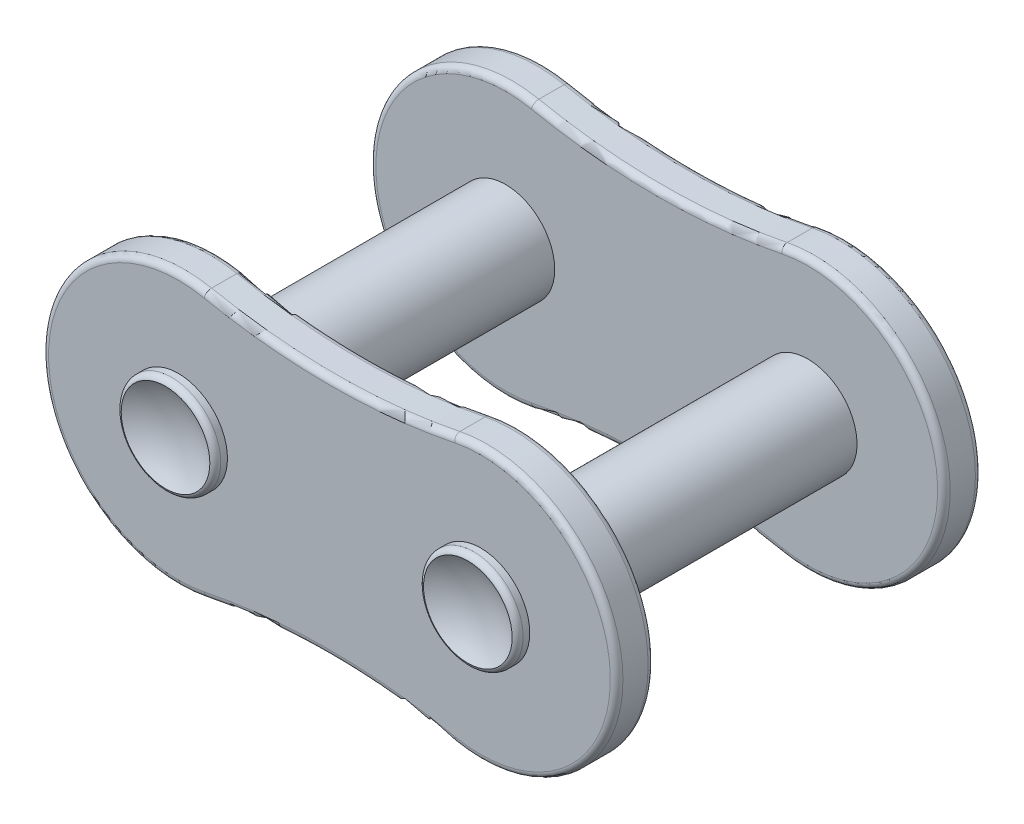
ISO-10303-21;
HEADER;
FILE_DESCRIPTION(('STEP AP214'),'2;1');
FILE_NAME('part.step','',(''),(''),'','','');
FILE_SCHEMA(('AUTOMOTIVE_DESIGN { 1 0 10303 214 1 1 1 1 }'));
ENDSEC;
DATA;
#1=APPLICATION_CONTEXT('core data for automotive mechanical design processes');
#2=APPLICATION_PROTOCOL_DEFINITION('international standard','automotive_design',2000,#1);
#3=PRODUCT_CONTEXT('',#1,'mechanical');
#4=PRODUCT('Part','Part','',(#3));
#5=PRODUCT_RELATED_PRODUCT_CATEGORY('part','',(#4));
#6=PRODUCT_DEFINITION_FORMATION('','',#4);
#7=PRODUCT_DEFINITION_CONTEXT('part definition',#1,'design');
#8=PRODUCT_DEFINITION('design','',#6,#7);
#9=PRODUCT_DEFINITION_SHAPE('','',#8);
#10=(LENGTH_UNIT() NAMED_UNIT(*) SI_UNIT(.MILLI.,.METRE.));
#11=(NAMED_UNIT(*) PLANE_ANGLE_UNIT() SI_UNIT($,.RADIAN.));
#12=(NAMED_UNIT(*) SI_UNIT($,.STERADIAN.) SOLID_ANGLE_UNIT());
#13=UNCERTAINTY_MEASURE_WITH_UNIT(LENGTH_MEASURE(1.E-05),#10,'distance_accuracy_value','');
#14=(GEOMETRIC_REPRESENTATION_CONTEXT(3) GLOBAL_UNCERTAINTY_ASSIGNED_CONTEXT((#13)) GLOBAL_UNIT_ASSIGNED_CONTEXT((#10,
#11,#12)) REPRESENTATION_CONTEXT('',''));
#15=CARTESIAN_POINT('',(0.,0.,0.));
#16=DIRECTION('',(0.,0.,1.));
#17=DIRECTION('',(1.,0.,0.));
#18=AXIS2_PLACEMENT_3D('',#15,#16,#17);
#19=CARTESIAN_POINT('',(1.5,7.40860737442853,4.373));
#20=DIRECTION('',(0.,0.,1.));
#21=DIRECTION('',(1.,0.,0.));
#22=AXIS2_PLACEMENT_3D('',#19,#20,#21);
#23=PLANE('',#22);
#24=CARTESIAN_POINT('',(0.,-14.8172147488571,4.373));
#25=DIRECTION('',(0.,0.,1.));
#26=DIRECTION('',(1.,0.,0.));
#27=AXIS2_PLACEMENT_3D('',#24,#25,#26);
#28=CIRCLE('',#27,12.5428653557223);
#29=CARTESIAN_POINT('',(-2.48901516065719,-2.52379069931756,4.373));
#30=VERTEX_POINT('',#29);
#31=CARTESIAN_POINT('',(2.48901516065719,-2.52379069931756,4.373));
#32=VERTEX_POINT('',#31);
#33=EDGE_CURVE('E312',#30,#32,#28,.F.);
#34=ORIENTED_EDGE('',*,*,#33,.T.);
#35=CARTESIAN_POINT('',(3.,0.,4.373));
#36=DIRECTION('',(0.,0.,1.));
#37=DIRECTION('',(1.,0.,0.));
#38=AXIS2_PLACEMENT_3D('',#35,#36,#37);
#39=CIRCLE('',#38,2.575);
#40=CARTESIAN_POINT('',(2.48901516065719,2.52379069931756,4.373));
#41=VERTEX_POINT('',#40);
#42=EDGE_CURVE('E314',#32,#41,#39,.T.);
#43=ORIENTED_EDGE('',*,*,#42,.T.);
#44=CARTESIAN_POINT('',(0.,14.8172147488571,4.373));
#45=DIRECTION('',(0.,0.,1.));
#46=DIRECTION('',(1.,0.,0.));
#47=AXIS2_PLACEMENT_3D('',#44,#45,#46);
#48=CIRCLE('',#47,12.5428653557223);
#49=CARTESIAN_POINT('',(-2.48901516065719,2.52379069931755,4.373));
#50=VERTEX_POINT('',#49);
#51=EDGE_CURVE('E197',#41,#50,#48,.F.);
#52=ORIENTED_EDGE('',*,*,#51,.T.);
#53=CARTESIAN_POINT('',(-3.,0.,4.373));
#54=DIRECTION('',(0.,0.,1.));
#55=DIRECTION('',(1.,0.,0.));
#56=AXIS2_PLACEMENT_3D('',#53,#54,#55);
#57=CIRCLE('',#56,2.575);
#58=EDGE_CURVE('E310',#50,#30,#57,.T.);
#59=ORIENTED_EDGE('',*,*,#58,.T.);
#60=EDGE_LOOP('',(#34,#43,#52,#59));
#61=FACE_BOUND('',#60,.T.);
#62=CARTESIAN_POINT('',(-3.,0.,4.373));
#63=DIRECTION('',(0.,0.,1.));
#64=DIRECTION('',(1.,0.,0.));
#65=AXIS2_PLACEMENT_3D('',#62,#63,#64);
#66=CIRCLE('',#65,0.974999999999999);
#67=CARTESIAN_POINT('',(-2.025,0.,4.373));
#68=VERTEX_POINT('',#67);
#69=EDGE_CURVE('E184',#68,#68,#66,.T.);
#70=ORIENTED_EDGE('',*,*,#69,.F.);
#71=EDGE_LOOP('',(#70));
#72=FACE_BOUND('',#71,.T.);
#73=CARTESIAN_POINT('',(3.,0.,4.373));
#74=DIRECTION('',(0.,0.,1.));
#75=DIRECTION('',(-1.,0.,0.));
#76=AXIS2_PLACEMENT_3D('',#73,#74,#75);
#77=CIRCLE('',#76,0.974999999999999);
#78=CARTESIAN_POINT('',(2.025,0.,4.373));
#79=VERTEX_POINT('',#78);
#80=EDGE_CURVE('E279',#79,#79,#77,.T.);
#81=ORIENTED_EDGE('',*,*,#80,.F.);
#82=EDGE_LOOP('',(#81));
#83=FACE_BOUND('',#82,.T.);
#84=ADVANCED_FACE('F46',(#61,#72,#83),#23,.T.);
#85=CARTESIAN_POINT('',(1.5,7.40860737442853,3.623));
#86=DIRECTION('',(0.,0.,1.));
#87=DIRECTION('',(1.,0.,0.));
#88=AXIS2_PLACEMENT_3D('',#85,#86,#87);
#89=PLANE('',#88);
#90=CARTESIAN_POINT('',(0.,14.8172147488571,3.623));
#91=DIRECTION('',(0.,0.,1.));
#92=DIRECTION('',(1.,0.,0.));
#93=AXIS2_PLACEMENT_3D('',#90,#91,#92);
#94=CIRCLE('',#93,12.5428653557223);
#95=CARTESIAN_POINT('',(-2.48901516065719,2.52379069931755,3.623));
#96=VERTEX_POINT('',#95);
#97=CARTESIAN_POINT('',(2.48901516065719,2.52379069931756,3.623));
#98=VERTEX_POINT('',#97);
#99=EDGE_CURVE('E292',#96,#98,#94,.T.);
#100=ORIENTED_EDGE('',*,*,#99,.T.);
#101=CARTESIAN_POINT('',(3.,0.,3.623));
#102=DIRECTION('',(0.,0.,1.));
#103=DIRECTION('',(1.,0.,0.));
#104=AXIS2_PLACEMENT_3D('',#101,#102,#103);
#105=CIRCLE('',#104,2.575);
#106=CARTESIAN_POINT('',(2.48901516065719,-2.52379069931756,3.623));
#107=VERTEX_POINT('',#106);
#108=EDGE_CURVE('E298',#98,#107,#105,.F.);
#109=ORIENTED_EDGE('',*,*,#108,.T.);
#110=CARTESIAN_POINT('',(0.,-14.8172147488571,3.623));
#111=DIRECTION('',(0.,0.,1.));
#112=DIRECTION('',(1.,0.,0.));
#113=AXIS2_PLACEMENT_3D('',#110,#111,#112);
#114=CIRCLE('',#113,12.5428653557223);
#115=CARTESIAN_POINT('',(-2.48901516065719,-2.52379069931756,3.623));
#116=VERTEX_POINT('',#115);
#117=EDGE_CURVE('E296',#107,#116,#114,.T.);
#118=ORIENTED_EDGE('',*,*,#117,.T.);
#119=CARTESIAN_POINT('',(-3.,0.,3.623));
#120=DIRECTION('',(0.,0.,1.));
#121=DIRECTION('',(1.,0.,0.));
#122=AXIS2_PLACEMENT_3D('',#119,#120,#121);
#123=CIRCLE('',#122,2.575);
#124=EDGE_CURVE('E294',#116,#96,#123,.F.);
#125=ORIENTED_EDGE('',*,*,#124,.T.);
#126=EDGE_LOOP('',(#100,#109,#118,#125));
#127=FACE_BOUND('',#126,.T.);
#128=CARTESIAN_POINT('',(-3.,0.,3.623));
#129=DIRECTION('',(0.,0.,1.));
#130=DIRECTION('',(1.,0.,0.));
#131=AXIS2_PLACEMENT_3D('',#128,#129,#130);
#132=CIRCLE('',#131,0.974999999999999);
#133=CARTESIAN_POINT('',(-2.025,0.,3.623));
#134=VERTEX_POINT('',#133);
#135=EDGE_CURVE('E276',#134,#134,#132,.T.);
#136=ORIENTED_EDGE('',*,*,#135,.T.);
#137=EDGE_LOOP('',(#136));
#138=FACE_BOUND('',#137,.T.);
#139=CARTESIAN_POINT('',(3.,0.,3.623));
#140=DIRECTION('',(0.,0.,1.));
#141=DIRECTION('',(1.,0.,0.));
#142=AXIS2_PLACEMENT_3D('',#139,#140,#141);
#143=CIRCLE('',#142,0.974999999999999);
#144=CARTESIAN_POINT('',(3.975,0.,3.623));
#145=VERTEX_POINT('',#144);
#146=EDGE_CURVE('E258',#145,#145,#143,.F.);
#147=ORIENTED_EDGE('',*,*,#146,.F.);
#148=EDGE_LOOP('',(#147));
#149=FACE_BOUND('',#148,.T.);
#150=ADVANCED_FACE('F377',(#127,#138,#149),#89,.F.);
#151=CARTESIAN_POINT('',(0.,14.8172147488571,4.373));
#152=DIRECTION('',(0.,0.,-1.));
#153=DIRECTION('',(-1.,0.,0.));
#154=AXIS2_PLACEMENT_3D('',#151,#152,#153);
#155=CYLINDRICAL_SURFACE('',#154,12.4178653557223);
#156=DIRECTION('',(0.,0.,-1.));
#157=VECTOR('',#156,1.);
#158=CARTESIAN_POINT('',(2.4642100713687,2.64630481093491,4.373));
#159=LINE('',#158,#157);
#160=CARTESIAN_POINT('',(2.4642100713687,2.64630481093491,4.248));
#161=VERTEX_POINT('',#160);
#162=CARTESIAN_POINT('',(2.4642100713687,2.64630481093491,3.748));
#163=VERTEX_POINT('',#162);
#164=EDGE_CURVE('E163',#161,#163,#159,.T.);
#165=ORIENTED_EDGE('',*,*,#164,.T.);
#166=CARTESIAN_POINT('',(0.,14.8172147488571,3.748));
#167=DIRECTION('',(0.,0.,1.));
#168=DIRECTION('',(1.,0.,0.));
#169=AXIS2_PLACEMENT_3D('',#166,#167,#168);
#170=CIRCLE('',#169,12.4178653557223);
#171=CARTESIAN_POINT('',(-2.4642100713687,2.64630481093491,3.748));
#172=VERTEX_POINT('',#171);
#173=EDGE_CURVE('E170',#163,#172,#170,.F.);
#174=ORIENTED_EDGE('',*,*,#173,.T.);
#175=DIRECTION('',(0.,0.,-1.));
#176=VECTOR('',#175,1.);
#177=CARTESIAN_POINT('',(-2.4642100713687,2.64630481093491,4.373));
#178=LINE('',#177,#176);
#179=CARTESIAN_POINT('',(-2.4642100713687,2.64630481093491,4.248));
#180=VERTEX_POINT('',#179);
#181=EDGE_CURVE('E165',#180,#172,#178,.T.);
#182=ORIENTED_EDGE('',*,*,#181,.F.);
#183=CARTESIAN_POINT('',(0.,14.8172147488571,4.248));
#184=DIRECTION('',(0.,0.,1.));
#185=DIRECTION('',(1.,0.,0.));
#186=AXIS2_PLACEMENT_3D('',#183,#184,#185);
#187=CIRCLE('',#186,12.4178653557223);
#188=EDGE_CURVE('E160',#180,#161,#187,.T.);
#189=ORIENTED_EDGE('',*,*,#188,.T.);
#190=EDGE_LOOP('',(#165,#174,#182,#189));
#191=FACE_BOUND('',#190,.T.);
#192=ADVANCED_FACE('F162',(#191),#155,.F.);
#193=CARTESIAN_POINT('',(-3.,0.,4.373));
#194=DIRECTION('',(0.,0.,-1.));
#195=DIRECTION('',(-1.,0.,0.));
#196=AXIS2_PLACEMENT_3D('',#193,#194,#195);
#197=CYLINDRICAL_SURFACE('',#196,2.7);
#198=ORIENTED_EDGE('',*,*,#181,.T.);
#199=CARTESIAN_POINT('',(-3.,0.,3.748));
#200=DIRECTION('',(0.,0.,1.));
#201=DIRECTION('',(1.,0.,0.));
#202=AXIS2_PLACEMENT_3D('',#199,#200,#201);
#203=CIRCLE('',#202,2.7);
#204=CARTESIAN_POINT('',(-2.4642100713687,-2.64630481093492,3.748));
#205=VERTEX_POINT('',#204);
#206=EDGE_CURVE('E307',#172,#205,#203,.T.);
#207=ORIENTED_EDGE('',*,*,#206,.T.);
#208=DIRECTION('',(0.,0.,-1.));
#209=VECTOR('',#208,1.);
#210=CARTESIAN_POINT('',(-2.4642100713687,-2.64630481093492,4.373));
#211=LINE('',#210,#209);
#212=CARTESIAN_POINT('',(-2.4642100713687,-2.64630481093492,4.248));
#213=VERTEX_POINT('',#212);
#214=EDGE_CURVE('E285',#213,#205,#211,.T.);
#215=ORIENTED_EDGE('',*,*,#214,.F.);
#216=CARTESIAN_POINT('',(-3.,0.,4.248));
#217=DIRECTION('',(0.,0.,1.));
#218=DIRECTION('',(1.,0.,0.));
#219=AXIS2_PLACEMENT_3D('',#216,#217,#218);
#220=CIRCLE('',#219,2.7);
#221=EDGE_CURVE('E305',#213,#180,#220,.F.);
#222=ORIENTED_EDGE('',*,*,#221,.T.);
#223=EDGE_LOOP('',(#198,#207,#215,#222));
#224=FACE_BOUND('',#223,.T.);
#225=ADVANCED_FACE('F385',(#224),#197,.T.);
#226=CARTESIAN_POINT('',(0.,-14.8172147488571,4.373));
#227=DIRECTION('',(0.,0.,-1.));
#228=DIRECTION('',(-1.,0.,0.));
#229=AXIS2_PLACEMENT_3D('',#226,#227,#228);
#230=CYLINDRICAL_SURFACE('',#229,12.4178653557223);
#231=ORIENTED_EDGE('',*,*,#214,.T.);
#232=CARTESIAN_POINT('',(0.,-14.8172147488571,3.748));
#233=DIRECTION('',(0.,0.,1.));
#234=DIRECTION('',(1.,0.,0.));
#235=AXIS2_PLACEMENT_3D('',#232,#233,#234);
#236=CIRCLE('',#235,12.4178653557223);
#237=CARTESIAN_POINT('',(2.4642100713687,-2.64630481093491,3.748));
#238=VERTEX_POINT('',#237);
#239=EDGE_CURVE('E303',#205,#238,#236,.F.);
#240=ORIENTED_EDGE('',*,*,#239,.T.);
#241=DIRECTION('',(0.,0.,-1.));
#242=VECTOR('',#241,1.);
#243=CARTESIAN_POINT('',(2.4642100713687,-2.64630481093491,4.373));
#244=LINE('',#243,#242);
#245=CARTESIAN_POINT('',(2.4642100713687,-2.64630481093491,4.248));
#246=VERTEX_POINT('',#245);
#247=EDGE_CURVE('E183',#246,#238,#244,.T.);
#248=ORIENTED_EDGE('',*,*,#247,.F.);
#249=CARTESIAN_POINT('',(0.,-14.8172147488571,4.248));
#250=DIRECTION('',(0.,0.,1.));
#251=DIRECTION('',(1.,0.,0.));
#252=AXIS2_PLACEMENT_3D('',#249,#250,#251);
#253=CIRCLE('',#252,12.4178653557223);
#254=EDGE_CURVE('E301',#246,#213,#253,.T.);
#255=ORIENTED_EDGE('',*,*,#254,.T.);
#256=EDGE_LOOP('',(#231,#240,#248,#255));
#257=FACE_BOUND('',#256,.T.);
#258=ADVANCED_FACE('F395',(#257),#230,.F.);
#259=CARTESIAN_POINT('',(3.,0.,4.373));
#260=DIRECTION('',(0.,0.,-1.));
#261=DIRECTION('',(-1.,0.,0.));
#262=AXIS2_PLACEMENT_3D('',#259,#260,#261);
#263=CYLINDRICAL_SURFACE('',#262,2.7);
#264=ORIENTED_EDGE('',*,*,#247,.T.);
#265=CARTESIAN_POINT('',(3.,0.,3.748));
#266=DIRECTION('',(0.,0.,1.));
#267=DIRECTION('',(1.,0.,0.));
#268=AXIS2_PLACEMENT_3D('',#265,#266,#267);
#269=CIRCLE('',#268,2.7);
#270=EDGE_CURVE('E182',#238,#163,#269,.T.);
#271=ORIENTED_EDGE('',*,*,#270,.T.);
#272=ORIENTED_EDGE('',*,*,#164,.F.);
#273=CARTESIAN_POINT('',(3.,0.,4.248));
#274=DIRECTION('',(0.,0.,1.));
#275=DIRECTION('',(1.,0.,0.));
#276=AXIS2_PLACEMENT_3D('',#273,#274,#275);
#277=CIRCLE('',#276,2.7);
#278=EDGE_CURVE('E179',#161,#246,#277,.F.);
#279=ORIENTED_EDGE('',*,*,#278,.T.);
#280=EDGE_LOOP('',(#264,#271,#272,#279));
#281=FACE_BOUND('',#280,.T.);
#282=ADVANCED_FACE('F178',(#281),#263,.T.);
#283=CARTESIAN_POINT('',(-3.,0.,3.369));
#284=DIRECTION('',(0.,0.,1.));
#285=DIRECTION('',(1.,0.,0.));
#286=AXIS2_PLACEMENT_3D('',#283,#284,#285);
#287=CYLINDRICAL_SURFACE('',#286,0.974999999999999);
#288=CARTESIAN_POINT('',(-3.,0.,3.49044648680803));
#289=DIRECTION('',(0.,0.,-1.));
#290=DIRECTION('',(-1.,0.,0.));
#291=AXIS2_PLACEMENT_3D('',#288,#289,#290);
#292=CIRCLE('',#291,0.974999999999999);
#293=CARTESIAN_POINT('',(-3.975,0.,3.49044648680803));
#294=VERTEX_POINT('',#293);
#295=EDGE_CURVE('E234',#294,#294,#292,.F.);
#296=ORIENTED_EDGE('',*,*,#295,.T.);
#297=EDGE_LOOP('',(#296));
#298=FACE_BOUND('',#297,.T.);
#299=ORIENTED_EDGE('',*,*,#135,.F.);
#300=EDGE_LOOP('',(#299));
#301=FACE_BOUND('',#300,.T.);
#302=ADVANCED_FACE('F394',(#298,#301),#287,.T.);
#303=CARTESIAN_POINT('',(-3.,0.,10.119));
#304=DIRECTION('',(0.,0.,-1.));
#305=DIRECTION('',(-1.,0.,0.));
#306=AXIS2_PLACEMENT_3D('',#303,#304,#305);
#307=CIRCLE('',#306,0.974999999999999);
#308=CARTESIAN_POINT('',(-3.975,0.,10.119));
#309=VERTEX_POINT('',#308);
#310=EDGE_CURVE('E194',#309,#309,#307,.F.);
#311=ORIENTED_EDGE('',*,*,#310,.F.);
#312=EDGE_LOOP('',(#311));
#313=FACE_BOUND('',#312,.T.);
#314=ORIENTED_EDGE('',*,*,#69,.T.);
#315=EDGE_LOOP('',(#314));
#316=FACE_BOUND('',#315,.T.);
#317=ADVANCED_FACE('F475',(#313,#316),#287,.T.);
#318=CARTESIAN_POINT('',(0.,14.8172147488571,10.119));
#319=DIRECTION('',(0.,0.,1.));
#320=DIRECTION('',(1.,0.,0.));
#321=AXIS2_PLACEMENT_3D('',#318,#319,#320);
#322=CYLINDRICAL_SURFACE('',#321,12.4178653557223);
#323=DIRECTION('',(0.,0.,1.));
#324=VECTOR('',#323,1.);
#325=CARTESIAN_POINT('',(2.4642100713687,2.64630481093491,10.119));
#326=LINE('',#325,#324);
#327=CARTESIAN_POINT('',(2.4642100713687,2.64630481093491,10.244));
#328=VERTEX_POINT('',#327);
#329=CARTESIAN_POINT('',(2.4642100713687,2.64630481093491,10.744));
#330=VERTEX_POINT('',#329);
#331=EDGE_CURVE('E273',#328,#330,#326,.T.);
#332=ORIENTED_EDGE('',*,*,#331,.F.);
#333=CARTESIAN_POINT('',(0.,14.8172147488571,10.244));
#334=DIRECTION('',(0.,0.,-1.));
#335=DIRECTION('',(-1.,0.,0.));
#336=AXIS2_PLACEMENT_3D('',#333,#334,#335);
#337=CIRCLE('',#336,12.4178653557223);
#338=CARTESIAN_POINT('',(-2.4642100713687,2.64630481093491,10.244));
#339=VERTEX_POINT('',#338);
#340=EDGE_CURVE('E235',#328,#339,#337,.T.);
#341=ORIENTED_EDGE('',*,*,#340,.T.);
#342=DIRECTION('',(0.,0.,1.));
#343=VECTOR('',#342,1.);
#344=CARTESIAN_POINT('',(-2.4642100713687,2.64630481093491,10.119));
#345=LINE('',#344,#343);
#346=CARTESIAN_POINT('',(-2.4642100713687,2.64630481093491,10.744));
#347=VERTEX_POINT('',#346);
#348=EDGE_CURVE('E264',#339,#347,#345,.T.);
#349=ORIENTED_EDGE('',*,*,#348,.T.);
#350=CARTESIAN_POINT('',(0.,14.8172147488571,10.744));
#351=DIRECTION('',(0.,0.,-1.));
#352=DIRECTION('',(-1.,0.,0.));
#353=AXIS2_PLACEMENT_3D('',#350,#351,#352);
#354=CIRCLE('',#353,12.4178653557223);
#355=EDGE_CURVE('E345',#347,#330,#354,.F.);
#356=ORIENTED_EDGE('',*,*,#355,.T.);
#357=EDGE_LOOP('',(#332,#341,#349,#356));
#358=FACE_BOUND('',#357,.T.);
#359=ADVANCED_FACE('F480',(#358),#322,.F.);
#360=CARTESIAN_POINT('',(3.,0.,10.119));
#361=DIRECTION('',(0.,0.,1.));
#362=DIRECTION('',(1.,0.,0.));
#363=AXIS2_PLACEMENT_3D('',#360,#361,#362);
#364=CYLINDRICAL_SURFACE('',#363,2.7);
#365=DIRECTION('',(0.,0.,1.));
#366=VECTOR('',#365,1.);
#367=CARTESIAN_POINT('',(2.4642100713687,-2.64630481093491,10.119));
#368=LINE('',#367,#366);
#369=CARTESIAN_POINT('',(2.4642100713687,-2.64630481093491,10.244));
#370=VERTEX_POINT('',#369);
#371=CARTESIAN_POINT('',(2.4642100713687,-2.64630481093491,10.744));
#372=VERTEX_POINT('',#371);
#373=EDGE_CURVE('E270',#370,#372,#368,.T.);
#374=ORIENTED_EDGE('',*,*,#373,.F.);
#375=CARTESIAN_POINT('',(3.,0.,10.244));
#376=DIRECTION('',(0.,0.,-1.));
#377=DIRECTION('',(-1.,0.,0.));
#378=AXIS2_PLACEMENT_3D('',#375,#376,#377);
#379=CIRCLE('',#378,2.7);
#380=EDGE_CURVE('E319',#370,#328,#379,.F.);
#381=ORIENTED_EDGE('',*,*,#380,.T.);
#382=ORIENTED_EDGE('',*,*,#331,.T.);
#383=CARTESIAN_POINT('',(3.,0.,10.744));
#384=DIRECTION('',(0.,0.,-1.));
#385=DIRECTION('',(-1.,0.,0.));
#386=AXIS2_PLACEMENT_3D('',#383,#384,#385);
#387=CIRCLE('',#386,2.7);
#388=EDGE_CURVE('E316',#330,#372,#387,.T.);
#389=ORIENTED_EDGE('',*,*,#388,.T.);
#390=EDGE_LOOP('',(#374,#381,#382,#389));
#391=FACE_BOUND('',#390,.T.);
#392=ADVANCED_FACE('F508',(#391),#364,.T.);
#393=CARTESIAN_POINT('',(0.,-14.8172147488571,10.119));
#394=DIRECTION('',(0.,0.,1.));
#395=DIRECTION('',(1.,0.,0.));
#396=AXIS2_PLACEMENT_3D('',#393,#394,#395);
#397=CYLINDRICAL_SURFACE('',#396,12.4178653557223);
#398=DIRECTION('',(0.,0.,1.));
#399=VECTOR('',#398,1.);
#400=CARTESIAN_POINT('',(-2.4642100713687,-2.64630481093492,10.119));
#401=LINE('',#400,#399);
#402=CARTESIAN_POINT('',(-2.4642100713687,-2.64630481093492,10.244));
#403=VERTEX_POINT('',#402);
#404=CARTESIAN_POINT('',(-2.4642100713687,-2.64630481093492,10.744));
#405=VERTEX_POINT('',#404);
#406=EDGE_CURVE('E267',#403,#405,#401,.T.);
#407=ORIENTED_EDGE('',*,*,#406,.F.);
#408=CARTESIAN_POINT('',(0.,-14.8172147488571,10.244));
#409=DIRECTION('',(0.,0.,-1.));
#410=DIRECTION('',(-1.,0.,0.));
#411=AXIS2_PLACEMENT_3D('',#408,#409,#410);
#412=CIRCLE('',#411,12.4178653557223);
#413=EDGE_CURVE('E333',#403,#370,#412,.T.);
#414=ORIENTED_EDGE('',*,*,#413,.T.);
#415=ORIENTED_EDGE('',*,*,#373,.T.);
#416=CARTESIAN_POINT('',(0.,-14.8172147488571,10.744));
#417=DIRECTION('',(0.,0.,-1.));
#418=DIRECTION('',(-1.,0.,0.));
#419=AXIS2_PLACEMENT_3D('',#416,#417,#418);
#420=CIRCLE('',#419,12.4178653557223);
#421=EDGE_CURVE('E331',#372,#405,#420,.F.);
#422=ORIENTED_EDGE('',*,*,#421,.T.);
#423=EDGE_LOOP('',(#407,#414,#415,#422));
#424=FACE_BOUND('',#423,.T.);
#425=ADVANCED_FACE('F504',(#424),#397,.F.);
#426=CARTESIAN_POINT('',(-3.,0.,10.119));
#427=DIRECTION('',(0.,0.,1.));
#428=DIRECTION('',(1.,0.,0.));
#429=AXIS2_PLACEMENT_3D('',#426,#427,#428);
#430=CYLINDRICAL_SURFACE('',#429,2.7);
#431=ORIENTED_EDGE('',*,*,#348,.F.);
#432=CARTESIAN_POINT('',(-3.,0.,10.244));
#433=DIRECTION('',(0.,0.,-1.));
#434=DIRECTION('',(-1.,0.,0.));
#435=AXIS2_PLACEMENT_3D('',#432,#433,#434);
#436=CIRCLE('',#435,2.7);
#437=EDGE_CURVE('E337',#339,#403,#436,.F.);
#438=ORIENTED_EDGE('',*,*,#437,.T.);
#439=ORIENTED_EDGE('',*,*,#406,.T.);
#440=CARTESIAN_POINT('',(-3.,0.,10.744));
#441=DIRECTION('',(0.,0.,-1.));
#442=DIRECTION('',(-1.,0.,0.));
#443=AXIS2_PLACEMENT_3D('',#440,#441,#442);
#444=CIRCLE('',#443,2.7);
#445=EDGE_CURVE('E335',#405,#347,#444,.T.);
#446=ORIENTED_EDGE('',*,*,#445,.T.);
#447=EDGE_LOOP('',(#431,#438,#439,#446));
#448=FACE_BOUND('',#447,.T.);
#449=ADVANCED_FACE('F497',(#448),#430,.T.);
#450=CARTESIAN_POINT('',(1.5,7.40860737442853,10.119));
#451=DIRECTION('',(0.,0.,-1.));
#452=DIRECTION('',(1.,0.,0.));
#453=AXIS2_PLACEMENT_3D('',#450,#451,#452);
#454=PLANE('',#453);
#455=CARTESIAN_POINT('',(0.,14.8172147488571,10.119));
#456=DIRECTION('',(0.,0.,-1.));
#457=DIRECTION('',(-1.,0.,0.));
#458=AXIS2_PLACEMENT_3D('',#455,#456,#457);
#459=CIRCLE('',#458,12.5428653557223);
#460=CARTESIAN_POINT('',(-2.48901516065719,2.52379069931755,10.119));
#461=VERTEX_POINT('',#460);
#462=CARTESIAN_POINT('',(2.48901516065719,2.52379069931756,10.119));
#463=VERTEX_POINT('',#462);
#464=EDGE_CURVE('E322',#461,#463,#459,.F.);
#465=ORIENTED_EDGE('',*,*,#464,.T.);
#466=CARTESIAN_POINT('',(3.,0.,10.119));
#467=DIRECTION('',(0.,0.,-1.));
#468=DIRECTION('',(-1.,0.,0.));
#469=AXIS2_PLACEMENT_3D('',#466,#467,#468);
#470=CIRCLE('',#469,2.575);
#471=CARTESIAN_POINT('',(2.48901516065719,-2.52379069931756,10.119));
#472=VERTEX_POINT('',#471);
#473=EDGE_CURVE('E328',#463,#472,#470,.T.);
#474=ORIENTED_EDGE('',*,*,#473,.T.);
#475=CARTESIAN_POINT('',(0.,-14.8172147488571,10.119));
#476=DIRECTION('',(0.,0.,-1.));
#477=DIRECTION('',(-1.,0.,0.));
#478=AXIS2_PLACEMENT_3D('',#475,#476,#477);
#479=CIRCLE('',#478,12.5428653557223);
#480=CARTESIAN_POINT('',(-2.48901516065719,-2.52379069931756,10.119));
#481=VERTEX_POINT('',#480);
#482=EDGE_CURVE('E326',#472,#481,#479,.F.);
#483=ORIENTED_EDGE('',*,*,#482,.T.);
#484=CARTESIAN_POINT('',(-3.,0.,10.119));
#485=DIRECTION('',(0.,0.,-1.));
#486=DIRECTION('',(-1.,0.,0.));
#487=AXIS2_PLACEMENT_3D('',#484,#485,#486);
#488=CIRCLE('',#487,2.575);
#489=EDGE_CURVE('E324',#481,#461,#488,.T.);
#490=ORIENTED_EDGE('',*,*,#489,.T.);
#491=EDGE_LOOP('',(#465,#474,#483,#490));
#492=FACE_BOUND('',#491,.T.);
#493=CARTESIAN_POINT('',(3.,0.,10.119));
#494=DIRECTION('',(0.,0.,-1.));
#495=DIRECTION('',(-1.,0.,0.));
#496=AXIS2_PLACEMENT_3D('',#493,#494,#495);
#497=CIRCLE('',#496,0.974999999999999);
#498=CARTESIAN_POINT('',(2.025,0.,10.119));
#499=VERTEX_POINT('',#498);
#500=EDGE_CURVE('E368',#499,#499,#497,.F.);
#501=ORIENTED_EDGE('',*,*,#500,.T.);
#502=EDGE_LOOP('',(#501));
#503=FACE_BOUND('',#502,.T.);
#504=ORIENTED_EDGE('',*,*,#310,.T.);
#505=EDGE_LOOP('',(#504));
#506=FACE_BOUND('',#505,.T.);
#507=ADVANCED_FACE('F492',(#492,#503,#506),#454,.T.);
#508=CARTESIAN_POINT('',(1.5,7.40860737442853,10.869));
#509=DIRECTION('',(0.,0.,-1.));
#510=DIRECTION('',(1.,0.,0.));
#511=AXIS2_PLACEMENT_3D('',#508,#509,#510);
#512=PLANE('',#511);
#513=CARTESIAN_POINT('',(0.,-14.8172147488571,10.869));
#514=DIRECTION('',(0.,0.,-1.));
#515=DIRECTION('',(-1.,0.,0.));
#516=AXIS2_PLACEMENT_3D('',#513,#514,#515);
#517=CIRCLE('',#516,12.5428653557223);
#518=CARTESIAN_POINT('',(-2.48901516065719,-2.52379069931756,10.869));
#519=VERTEX_POINT('',#518);
#520=CARTESIAN_POINT('',(2.48901516065719,-2.52379069931756,10.869));
#521=VERTEX_POINT('',#520);
#522=EDGE_CURVE('E61',#519,#521,#517,.T.);
#523=ORIENTED_EDGE('',*,*,#522,.T.);
#524=CARTESIAN_POINT('',(3.,0.,10.869));
#525=DIRECTION('',(0.,0.,-1.));
#526=DIRECTION('',(-1.,0.,0.));
#527=AXIS2_PLACEMENT_3D('',#524,#525,#526);
#528=CIRCLE('',#527,2.575);
#529=CARTESIAN_POINT('',(2.48901516065719,2.52379069931756,10.869));
#530=VERTEX_POINT('',#529);
#531=EDGE_CURVE('E171',#521,#530,#528,.F.);
#532=ORIENTED_EDGE('',*,*,#531,.T.);
#533=CARTESIAN_POINT('',(0.,14.8172147488571,10.869));
#534=DIRECTION('',(0.,0.,-1.));
#535=DIRECTION('',(-1.,0.,0.));
#536=AXIS2_PLACEMENT_3D('',#533,#534,#535);
#537=CIRCLE('',#536,12.5428653557223);
#538=CARTESIAN_POINT('',(-2.48901516065719,2.52379069931755,10.869));
#539=VERTEX_POINT('',#538);
#540=EDGE_CURVE('E339',#530,#539,#537,.T.);
#541=ORIENTED_EDGE('',*,*,#540,.T.);
#542=CARTESIAN_POINT('',(-3.,0.,10.869));
#543=DIRECTION('',(0.,0.,-1.));
#544=DIRECTION('',(-1.,0.,0.));
#545=AXIS2_PLACEMENT_3D('',#542,#543,#544);
#546=CIRCLE('',#545,2.575);
#547=EDGE_CURVE('E66',#539,#519,#546,.F.);
#548=ORIENTED_EDGE('',*,*,#547,.T.);
#549=EDGE_LOOP('',(#523,#532,#541,#548));
#550=FACE_BOUND('',#549,.T.);
#551=CARTESIAN_POINT('',(3.,0.,10.869));
#552=DIRECTION('',(0.,0.,1.));
#553=DIRECTION('',(-1.,0.,0.));
#554=AXIS2_PLACEMENT_3D('',#551,#552,#553);
#555=CIRCLE('',#554,0.974999999999999);
#556=CARTESIAN_POINT('',(2.025,0.,10.869));
#557=VERTEX_POINT('',#556);
#558=EDGE_CURVE('E251',#557,#557,#555,.T.);
#559=ORIENTED_EDGE('',*,*,#558,.F.);
#560=EDGE_LOOP('',(#559));
#561=FACE_BOUND('',#560,.T.);
#562=CARTESIAN_POINT('',(-3.,0.,10.869));
#563=DIRECTION('',(0.,0.,1.));
#564=DIRECTION('',(1.,0.,0.));
#565=AXIS2_PLACEMENT_3D('',#562,#563,#564);
#566=CIRCLE('',#565,0.974999999999999);
#567=CARTESIAN_POINT('',(-2.025,0.,10.869));
#568=VERTEX_POINT('',#567);
#569=EDGE_CURVE('E255',#568,#568,#566,.T.);
#570=ORIENTED_EDGE('',*,*,#569,.F.);
#571=EDGE_LOOP('',(#570));
#572=FACE_BOUND('',#571,.T.);
#573=ADVANCED_FACE('F485',(#550,#561,#572),#512,.F.);
#574=CARTESIAN_POINT('',(-3.,0.,11.001553513192));
#575=DIRECTION('',(0.,0.,1.));
#576=DIRECTION('',(1.,0.,0.));
#577=AXIS2_PLACEMENT_3D('',#574,#575,#576);
#578=CIRCLE('',#577,0.974999999999999);
#579=CARTESIAN_POINT('',(-2.025,0.,11.001553513192));
#580=VERTEX_POINT('',#579);
#581=EDGE_CURVE('E54',#580,#580,#578,.F.);
#582=ORIENTED_EDGE('',*,*,#581,.T.);
#583=EDGE_LOOP('',(#582));
#584=FACE_BOUND('',#583,.T.);
#585=ORIENTED_EDGE('',*,*,#569,.T.);
#586=EDGE_LOOP('',(#585));
#587=FACE_BOUND('',#586,.T.);
#588=ADVANCED_FACE('F240',(#584,#587),#287,.T.);
#589=CARTESIAN_POINT('',(-3.,0.,12.519));
#590=DIRECTION('',(0.,0.,-1.));
#591=DIRECTION('',(1.,0.,0.));
#592=AXIS2_PLACEMENT_3D('',#589,#590,#591);
#593=SPHERICAL_SURFACE('',#592,1.65);
#594=CARTESIAN_POINT('',(-3.,0.,11.123));
#595=DIRECTION('',(0.,0.,-1.));
#596=DIRECTION('',(-1.,0.,0.));
#597=AXIS2_PLACEMENT_3D('',#594,#595,#596);
#598=CIRCLE('',#597,0.879593087740008);
#599=CARTESIAN_POINT('',(-3.87959308774001,0.,11.123));
#600=VERTEX_POINT('',#599);
#601=EDGE_CURVE('E249',#600,#600,#598,.T.);
#602=ORIENTED_EDGE('',*,*,#601,.F.);
#603=EDGE_LOOP('',(#602));
#604=FACE_BOUND('',#603,.T.);
#605=ADVANCED_FACE('F484',(#604),#593,.F.);
#606=CARTESIAN_POINT('',(-3.,0.,1.973));
#607=DIRECTION('',(0.,0.,1.));
#608=DIRECTION('',(1.,0.,0.));
#609=AXIS2_PLACEMENT_3D('',#606,#607,#608);
#610=SPHERICAL_SURFACE('',#609,1.65);
#611=CARTESIAN_POINT('',(-3.,0.,3.369));
#612=DIRECTION('',(0.,0.,-1.));
#613=DIRECTION('',(-1.,0.,0.));
#614=AXIS2_PLACEMENT_3D('',#611,#612,#613);
#615=CIRCLE('',#614,0.879593087740008);
#616=CARTESIAN_POINT('',(-3.87959308774001,0.,3.369));
#617=VERTEX_POINT('',#616);
#618=EDGE_CURVE('E252',#617,#617,#615,.T.);
#619=ORIENTED_EDGE('',*,*,#618,.T.);
#620=EDGE_LOOP('',(#619));
#621=FACE_BOUND('',#620,.T.);
#622=ADVANCED_FACE('F490',(#621),#610,.F.);
#623=CARTESIAN_POINT('',(3.,0.,3.369));
#624=DIRECTION('',(0.,0.,1.));
#625=DIRECTION('',(1.,0.,0.));
#626=AXIS2_PLACEMENT_3D('',#623,#624,#625);
#627=CYLINDRICAL_SURFACE('',#626,0.974999999999999);
#628=CARTESIAN_POINT('',(3.,0.,11.001553513192));
#629=DIRECTION('',(0.,0.,1.));
#630=DIRECTION('',(1.,0.,0.));
#631=AXIS2_PLACEMENT_3D('',#628,#629,#630);
#632=CIRCLE('',#631,0.974999999999999);
#633=CARTESIAN_POINT('',(3.975,0.,11.001553513192));
#634=VERTEX_POINT('',#633);
#635=EDGE_CURVE('E13',#634,#634,#632,.F.);
#636=ORIENTED_EDGE('',*,*,#635,.T.);
#637=EDGE_LOOP('',(#636));
#638=FACE_BOUND('',#637,.T.);
#639=ORIENTED_EDGE('',*,*,#558,.T.);
#640=EDGE_LOOP('',(#639));
#641=FACE_BOUND('',#640,.T.);
#642=ADVANCED_FACE('F553',(#638,#641),#627,.T.);
#643=ORIENTED_EDGE('',*,*,#80,.T.);
#644=EDGE_LOOP('',(#643));
#645=FACE_BOUND('',#644,.T.);
#646=ORIENTED_EDGE('',*,*,#500,.F.);
#647=EDGE_LOOP('',(#646));
#648=FACE_BOUND('',#647,.T.);
#649=ADVANCED_FACE('F550',(#645,#648),#627,.T.);
#650=CARTESIAN_POINT('',(3.,0.,3.49044648680803));
#651=DIRECTION('',(0.,0.,-1.));
#652=DIRECTION('',(-1.,0.,0.));
#653=AXIS2_PLACEMENT_3D('',#650,#651,#652);
#654=CIRCLE('',#653,0.974999999999999);
#655=CARTESIAN_POINT('',(2.025,0.,3.49044648680803));
#656=VERTEX_POINT('',#655);
#657=EDGE_CURVE('E231',#656,#656,#654,.F.);
#658=ORIENTED_EDGE('',*,*,#657,.T.);
#659=EDGE_LOOP('',(#658));
#660=FACE_BOUND('',#659,.T.);
#661=ORIENTED_EDGE('',*,*,#146,.T.);
#662=EDGE_LOOP('',(#661));
#663=FACE_BOUND('',#662,.T.);
#664=ADVANCED_FACE('F375',(#660,#663),#627,.T.);
#665=CARTESIAN_POINT('',(3.,0.,12.519));
#666=DIRECTION('',(0.,0.,-1.));
#667=DIRECTION('',(-1.,0.,0.));
#668=AXIS2_PLACEMENT_3D('',#665,#666,#667);
#669=SPHERICAL_SURFACE('',#668,1.65);
#670=CARTESIAN_POINT('',(3.,0.,11.123));
#671=DIRECTION('',(0.,0.,1.));
#672=DIRECTION('',(1.,0.,0.));
#673=AXIS2_PLACEMENT_3D('',#670,#671,#672);
#674=CIRCLE('',#673,0.879593087740008);
#675=CARTESIAN_POINT('',(3.87959308774001,0.,11.123));
#676=VERTEX_POINT('',#675);
#677=EDGE_CURVE('E363',#676,#676,#674,.T.);
#678=ORIENTED_EDGE('',*,*,#677,.T.);
#679=EDGE_LOOP('',(#678));
#680=FACE_BOUND('',#679,.T.);
#681=ADVANCED_FACE('F559',(#680),#669,.F.);
#682=CARTESIAN_POINT('',(3.,0.,1.973));
#683=DIRECTION('',(0.,0.,1.));
#684=DIRECTION('',(-1.,0.,0.));
#685=AXIS2_PLACEMENT_3D('',#682,#683,#684);
#686=SPHERICAL_SURFACE('',#685,1.65);
#687=CARTESIAN_POINT('',(3.,0.,3.369));
#688=DIRECTION('',(0.,0.,1.));
#689=DIRECTION('',(1.,0.,0.));
#690=AXIS2_PLACEMENT_3D('',#687,#688,#689);
#691=CIRCLE('',#690,0.879593087740008);
#692=CARTESIAN_POINT('',(3.87959308774001,0.,3.369));
#693=VERTEX_POINT('',#692);
#694=EDGE_CURVE('E357',#693,#693,#691,.T.);
#695=ORIENTED_EDGE('',*,*,#694,.F.);
#696=EDGE_LOOP('',(#695));
#697=FACE_BOUND('',#696,.T.);
#698=ADVANCED_FACE('F416',(#697),#686,.F.);
#699=CARTESIAN_POINT('',(-3.,0.,3.748));
#700=DIRECTION('',(0.,0.,1.));
#701=DIRECTION('',(1.,0.,0.));
#702=AXIS2_PLACEMENT_3D('',#699,#700,#701);
#703=TOROIDAL_SURFACE('',#702,2.575,0.125);
#704=CARTESIAN_POINT('',(-2.48901516065719,2.52379069931755,3.748));
#705=DIRECTION('',(0.980112892938857,-0.198440714307888,0.));
#706=DIRECTION('',(0.198440714307888,0.980112892938857,0.));
#707=AXIS2_PLACEMENT_3D('',#704,#705,#706);
#708=CIRCLE('',#707,0.125);
#709=EDGE_CURVE('E350',#96,#172,#708,.T.);
#710=ORIENTED_EDGE('',*,*,#709,.F.);
#711=ORIENTED_EDGE('',*,*,#124,.F.);
#712=CARTESIAN_POINT('',(-2.48901516065719,-2.52379069931756,3.748));
#713=DIRECTION('',(0.980112892938857,0.198440714307888,0.));
#714=DIRECTION('',(-0.198440714307888,0.980112892938857,0.));
#715=AXIS2_PLACEMENT_3D('',#712,#713,#714);
#716=CIRCLE('',#715,0.125);
#717=EDGE_CURVE('E207',#205,#116,#716,.T.);
#718=ORIENTED_EDGE('',*,*,#717,.F.);
#719=ORIENTED_EDGE('',*,*,#206,.F.);
#720=EDGE_LOOP('',(#710,#711,#718,#719));
#721=FACE_BOUND('',#720,.T.);
#722=ADVANCED_FACE('F413',(#721),#703,.T.);
#723=CARTESIAN_POINT('',(0.,-14.8172147488571,3.748));
#724=DIRECTION('',(0.,0.,1.));
#725=DIRECTION('',(1.,0.,0.));
#726=AXIS2_PLACEMENT_3D('',#723,#724,#725);
#727=TOROIDAL_SURFACE('',#726,12.5428653557223,0.125);
#728=ORIENTED_EDGE('',*,*,#717,.T.);
#729=ORIENTED_EDGE('',*,*,#117,.F.);
#730=CARTESIAN_POINT('',(2.48901516065719,-2.52379069931755,3.748));
#731=DIRECTION('',(0.980112892938857,-0.198440714307888,0.));
#732=DIRECTION('',(0.198440714307888,0.980112892938857,0.));
#733=AXIS2_PLACEMENT_3D('',#730,#731,#732);
#734=CIRCLE('',#733,0.125);
#735=EDGE_CURVE('E349',#238,#107,#734,.T.);
#736=ORIENTED_EDGE('',*,*,#735,.F.);
#737=ORIENTED_EDGE('',*,*,#239,.F.);
#738=EDGE_LOOP('',(#728,#729,#736,#737));
#739=FACE_BOUND('',#738,.T.);
#740=ADVANCED_FACE('F410',(#739),#727,.T.);
#741=CARTESIAN_POINT('',(0.,14.8172147488571,3.748));
#742=DIRECTION('',(0.,0.,1.));
#743=DIRECTION('',(1.,0.,0.));
#744=AXIS2_PLACEMENT_3D('',#741,#742,#743);
#745=TOROIDAL_SURFACE('',#744,12.5428653557223,0.125);
#746=ORIENTED_EDGE('',*,*,#709,.T.);
#747=ORIENTED_EDGE('',*,*,#173,.F.);
#748=CARTESIAN_POINT('',(2.48901516065719,2.52379069931756,3.748));
#749=DIRECTION('',(0.980112892938857,0.198440714307888,0.));
#750=DIRECTION('',(-0.198440714307888,0.980112892938857,0.));
#751=AXIS2_PLACEMENT_3D('',#748,#749,#750);
#752=CIRCLE('',#751,0.125);
#753=EDGE_CURVE('E214',#98,#163,#752,.T.);
#754=ORIENTED_EDGE('',*,*,#753,.F.);
#755=ORIENTED_EDGE('',*,*,#99,.F.);
#756=EDGE_LOOP('',(#746,#747,#754,#755));
#757=FACE_BOUND('',#756,.T.);
#758=ADVANCED_FACE('F406',(#757),#745,.T.);
#759=CARTESIAN_POINT('',(3.,0.,3.748));
#760=DIRECTION('',(0.,0.,1.));
#761=DIRECTION('',(1.,0.,0.));
#762=AXIS2_PLACEMENT_3D('',#759,#760,#761);
#763=TOROIDAL_SURFACE('',#762,2.575,0.125);
#764=ORIENTED_EDGE('',*,*,#735,.T.);
#765=ORIENTED_EDGE('',*,*,#108,.F.);
#766=ORIENTED_EDGE('',*,*,#753,.T.);
#767=ORIENTED_EDGE('',*,*,#270,.F.);
#768=EDGE_LOOP('',(#764,#765,#766,#767));
#769=FACE_BOUND('',#768,.T.);
#770=ADVANCED_FACE('F402',(#769),#763,.T.);
#771=CARTESIAN_POINT('',(-3.,0.,4.248));
#772=DIRECTION('',(0.,0.,1.));
#773=DIRECTION('',(1.,0.,0.));
#774=AXIS2_PLACEMENT_3D('',#771,#772,#773);
#775=TOROIDAL_SURFACE('',#774,2.575,0.125);
#776=CARTESIAN_POINT('',(-2.48901516065719,2.52379069931755,4.248));
#777=DIRECTION('',(0.980112892938857,-0.198440714307888,0.));
#778=DIRECTION('',(0.198440714307888,0.980112892938857,0.));
#779=AXIS2_PLACEMENT_3D('',#776,#777,#778);
#780=CIRCLE('',#779,0.125);
#781=EDGE_CURVE('E201',#180,#50,#780,.T.);
#782=ORIENTED_EDGE('',*,*,#781,.F.);
#783=ORIENTED_EDGE('',*,*,#221,.F.);
#784=CARTESIAN_POINT('',(-2.48901516065719,-2.52379069931756,4.248));
#785=DIRECTION('',(0.980112892938857,0.198440714307888,0.));
#786=DIRECTION('',(-0.198440714307888,0.980112892938857,0.));
#787=AXIS2_PLACEMENT_3D('',#784,#785,#786);
#788=CIRCLE('',#787,0.125);
#789=EDGE_CURVE('E211',#30,#213,#788,.T.);
#790=ORIENTED_EDGE('',*,*,#789,.F.);
#791=ORIENTED_EDGE('',*,*,#58,.F.);
#792=EDGE_LOOP('',(#782,#783,#790,#791));
#793=FACE_BOUND('',#792,.T.);
#794=ADVANCED_FACE('F405',(#793),#775,.T.);
#795=CARTESIAN_POINT('',(0.,-14.8172147488571,4.248));
#796=DIRECTION('',(0.,0.,1.));
#797=DIRECTION('',(1.,0.,0.));
#798=AXIS2_PLACEMENT_3D('',#795,#796,#797);
#799=TOROIDAL_SURFACE('',#798,12.5428653557223,0.125);
#800=ORIENTED_EDGE('',*,*,#789,.T.);
#801=ORIENTED_EDGE('',*,*,#254,.F.);
#802=CARTESIAN_POINT('',(2.48901516065719,-2.52379069931756,4.248));
#803=DIRECTION('',(0.980112892938857,-0.198440714307887,0.));
#804=DIRECTION('',(0.198440714307887,0.980112892938857,0.));
#805=AXIS2_PLACEMENT_3D('',#802,#803,#804);
#806=CIRCLE('',#805,0.125);
#807=EDGE_CURVE('E192',#32,#246,#806,.T.);
#808=ORIENTED_EDGE('',*,*,#807,.F.);
#809=ORIENTED_EDGE('',*,*,#33,.F.);
#810=EDGE_LOOP('',(#800,#801,#808,#809));
#811=FACE_BOUND('',#810,.T.);
#812=ADVANCED_FACE('F423',(#811),#799,.T.);
#813=CARTESIAN_POINT('',(0.,14.8172147488571,4.248));
#814=DIRECTION('',(0.,0.,1.));
#815=DIRECTION('',(1.,0.,0.));
#816=AXIS2_PLACEMENT_3D('',#813,#814,#815);
#817=TOROIDAL_SURFACE('',#816,12.5428653557223,0.125);
#818=ORIENTED_EDGE('',*,*,#781,.T.);
#819=ORIENTED_EDGE('',*,*,#51,.F.);
#820=CARTESIAN_POINT('',(2.48901516065719,2.52379069931755,4.248));
#821=DIRECTION('',(0.980112892938857,0.198440714307888,0.));
#822=DIRECTION('',(-0.198440714307888,0.980112892938857,0.));
#823=AXIS2_PLACEMENT_3D('',#820,#821,#822);
#824=CIRCLE('',#823,0.125);
#825=EDGE_CURVE('E189',#161,#41,#824,.T.);
#826=ORIENTED_EDGE('',*,*,#825,.F.);
#827=ORIENTED_EDGE('',*,*,#188,.F.);
#828=EDGE_LOOP('',(#818,#819,#826,#827));
#829=FACE_BOUND('',#828,.T.);
#830=ADVANCED_FACE('F196',(#829),#817,.T.);
#831=CARTESIAN_POINT('',(3.,0.,4.248));
#832=DIRECTION('',(0.,0.,1.));
#833=DIRECTION('',(1.,0.,0.));
#834=AXIS2_PLACEMENT_3D('',#831,#832,#833);
#835=TOROIDAL_SURFACE('',#834,2.575,0.125);
#836=ORIENTED_EDGE('',*,*,#807,.T.);
#837=ORIENTED_EDGE('',*,*,#278,.F.);
#838=ORIENTED_EDGE('',*,*,#825,.T.);
#839=ORIENTED_EDGE('',*,*,#42,.F.);
#840=EDGE_LOOP('',(#836,#837,#838,#839));
#841=FACE_BOUND('',#840,.T.);
#842=ADVANCED_FACE('F187',(#841),#835,.T.);
#843=CARTESIAN_POINT('',(-3.,0.,10.244));
#844=DIRECTION('',(0.,0.,-1.));
#845=DIRECTION('',(-1.,0.,0.));
#846=AXIS2_PLACEMENT_3D('',#843,#844,#845);
#847=TOROIDAL_SURFACE('',#846,2.575,0.125);
#848=CARTESIAN_POINT('',(-2.48901516065719,2.52379069931755,10.244));
#849=DIRECTION('',(0.980112892938857,-0.198440714307888,0.));
#850=DIRECTION('',(0.198440714307888,0.980112892938857,0.));
#851=AXIS2_PLACEMENT_3D('',#848,#849,#850);
#852=CIRCLE('',#851,0.125);
#853=EDGE_CURVE('E204',#461,#339,#852,.T.);
#854=ORIENTED_EDGE('',*,*,#853,.F.);
#855=ORIENTED_EDGE('',*,*,#489,.F.);
#856=CARTESIAN_POINT('',(-2.48901516065719,-2.52379069931756,10.244));
#857=DIRECTION('',(0.980112892938857,0.198440714307888,0.));
#858=DIRECTION('',(-0.198440714307888,0.980112892938857,0.));
#859=AXIS2_PLACEMENT_3D('',#856,#857,#858);
#860=CIRCLE('',#859,0.125);
#861=EDGE_CURVE('E199',#403,#481,#860,.T.);
#862=ORIENTED_EDGE('',*,*,#861,.F.);
#863=ORIENTED_EDGE('',*,*,#437,.F.);
#864=EDGE_LOOP('',(#854,#855,#862,#863));
#865=FACE_BOUND('',#864,.T.);
#866=ADVANCED_FACE('F420',(#865),#847,.T.);
#867=CARTESIAN_POINT('',(0.,-14.8172147488571,10.244));
#868=DIRECTION('',(0.,0.,-1.));
#869=DIRECTION('',(-1.,0.,0.));
#870=AXIS2_PLACEMENT_3D('',#867,#868,#869);
#871=TOROIDAL_SURFACE('',#870,12.5428653557223,0.125);
#872=ORIENTED_EDGE('',*,*,#861,.T.);
#873=ORIENTED_EDGE('',*,*,#482,.F.);
#874=CARTESIAN_POINT('',(2.48901516065719,-2.52379069931755,10.244));
#875=DIRECTION('',(0.980112892938857,-0.198440714307888,0.));
#876=DIRECTION('',(0.198440714307888,0.980112892938857,0.));
#877=AXIS2_PLACEMENT_3D('',#874,#875,#876);
#878=CIRCLE('',#877,0.125);
#879=EDGE_CURVE('E217',#370,#472,#878,.T.);
#880=ORIENTED_EDGE('',*,*,#879,.F.);
#881=ORIENTED_EDGE('',*,*,#413,.F.);
#882=EDGE_LOOP('',(#872,#873,#880,#881));
#883=FACE_BOUND('',#882,.T.);
#884=ADVANCED_FACE('F438',(#883),#871,.T.);
#885=CARTESIAN_POINT('',(0.,14.8172147488571,10.244));
#886=DIRECTION('',(0.,0.,-1.));
#887=DIRECTION('',(-1.,0.,0.));
#888=AXIS2_PLACEMENT_3D('',#885,#886,#887);
#889=TOROIDAL_SURFACE('',#888,12.5428653557223,0.125);
#890=ORIENTED_EDGE('',*,*,#853,.T.);
#891=ORIENTED_EDGE('',*,*,#340,.F.);
#892=CARTESIAN_POINT('',(2.48901516065719,2.52379069931756,10.244));
#893=DIRECTION('',(0.980112892938857,0.198440714307888,0.));
#894=DIRECTION('',(-0.198440714307888,0.980112892938857,0.));
#895=AXIS2_PLACEMENT_3D('',#892,#893,#894);
#896=CIRCLE('',#895,0.125);
#897=EDGE_CURVE('E215',#463,#328,#896,.T.);
#898=ORIENTED_EDGE('',*,*,#897,.F.);
#899=ORIENTED_EDGE('',*,*,#464,.F.);
#900=EDGE_LOOP('',(#890,#891,#898,#899));
#901=FACE_BOUND('',#900,.T.);
#902=ADVANCED_FACE('F434',(#901),#889,.T.);
#903=CARTESIAN_POINT('',(3.,0.,10.244));
#904=DIRECTION('',(0.,0.,-1.));
#905=DIRECTION('',(-1.,0.,0.));
#906=AXIS2_PLACEMENT_3D('',#903,#904,#905);
#907=TOROIDAL_SURFACE('',#906,2.575,0.125);
#908=ORIENTED_EDGE('',*,*,#879,.T.);
#909=ORIENTED_EDGE('',*,*,#473,.F.);
#910=ORIENTED_EDGE('',*,*,#897,.T.);
#911=ORIENTED_EDGE('',*,*,#380,.F.);
#912=EDGE_LOOP('',(#908,#909,#910,#911));
#913=FACE_BOUND('',#912,.T.);
#914=ADVANCED_FACE('F430',(#913),#907,.T.);
#915=CARTESIAN_POINT('',(-3.,0.,10.744));
#916=DIRECTION('',(0.,0.,-1.));
#917=DIRECTION('',(-1.,0.,0.));
#918=AXIS2_PLACEMENT_3D('',#915,#916,#917);
#919=TOROIDAL_SURFACE('',#918,2.575,0.125);
#920=CARTESIAN_POINT('',(-2.48901516065719,2.52379069931755,10.744));
#921=DIRECTION('',(0.980112892938857,-0.198440714307888,0.));
#922=DIRECTION('',(0.198440714307888,0.980112892938857,0.));
#923=AXIS2_PLACEMENT_3D('',#920,#921,#922);
#924=CIRCLE('',#923,0.125);
#925=EDGE_CURVE('E226',#347,#539,#924,.T.);
#926=ORIENTED_EDGE('',*,*,#925,.F.);
#927=ORIENTED_EDGE('',*,*,#445,.F.);
#928=CARTESIAN_POINT('',(-2.48901516065719,-2.52379069931756,10.744));
#929=DIRECTION('',(0.980112892938857,0.198440714307888,0.));
#930=DIRECTION('',(-0.198440714307888,0.980112892938857,0.));
#931=AXIS2_PLACEMENT_3D('',#928,#929,#930);
#932=CIRCLE('',#931,0.125);
#933=EDGE_CURVE('E218',#519,#405,#932,.T.);
#934=ORIENTED_EDGE('',*,*,#933,.F.);
#935=ORIENTED_EDGE('',*,*,#547,.F.);
#936=EDGE_LOOP('',(#926,#927,#934,#935));
#937=FACE_BOUND('',#936,.T.);
#938=ADVANCED_FACE('F433',(#937),#919,.T.);
#939=CARTESIAN_POINT('',(0.,-14.8172147488571,10.744));
#940=DIRECTION('',(0.,0.,-1.));
#941=DIRECTION('',(-1.,0.,0.));
#942=AXIS2_PLACEMENT_3D('',#939,#940,#941);
#943=TOROIDAL_SURFACE('',#942,12.5428653557223,0.125);
#944=ORIENTED_EDGE('',*,*,#933,.T.);
#945=ORIENTED_EDGE('',*,*,#421,.F.);
#946=CARTESIAN_POINT('',(2.48901516065719,-2.52379069931756,10.744));
#947=DIRECTION('',(0.980112892938857,-0.198440714307887,0.));
#948=DIRECTION('',(0.198440714307887,0.980112892938857,0.));
#949=AXIS2_PLACEMENT_3D('',#946,#947,#948);
#950=CIRCLE('',#949,0.125);
#951=EDGE_CURVE('E224',#521,#372,#950,.T.);
#952=ORIENTED_EDGE('',*,*,#951,.F.);
#953=ORIENTED_EDGE('',*,*,#522,.F.);
#954=EDGE_LOOP('',(#944,#945,#952,#953));
#955=FACE_BOUND('',#954,.T.);
#956=ADVANCED_FACE('F454',(#955),#943,.T.);
#957=CARTESIAN_POINT('',(0.,14.8172147488571,10.744));
#958=DIRECTION('',(0.,0.,-1.));
#959=DIRECTION('',(-1.,0.,0.));
#960=AXIS2_PLACEMENT_3D('',#957,#958,#959);
#961=TOROIDAL_SURFACE('',#960,12.5428653557223,0.125);
#962=ORIENTED_EDGE('',*,*,#925,.T.);
#963=ORIENTED_EDGE('',*,*,#540,.F.);
#964=CARTESIAN_POINT('',(2.48901516065719,2.52379069931755,10.744));
#965=DIRECTION('',(0.980112892938857,0.198440714307888,0.));
#966=DIRECTION('',(-0.198440714307888,0.980112892938857,0.));
#967=AXIS2_PLACEMENT_3D('',#964,#965,#966);
#968=CIRCLE('',#967,0.125);
#969=EDGE_CURVE('E222',#330,#530,#968,.T.);
#970=ORIENTED_EDGE('',*,*,#969,.F.);
#971=ORIENTED_EDGE('',*,*,#355,.F.);
#972=EDGE_LOOP('',(#962,#963,#970,#971));
#973=FACE_BOUND('',#972,.T.);
#974=ADVANCED_FACE('F450',(#973),#961,.T.);
#975=CARTESIAN_POINT('',(3.,0.,10.744));
#976=DIRECTION('',(0.,0.,-1.));
#977=DIRECTION('',(-1.,0.,0.));
#978=AXIS2_PLACEMENT_3D('',#975,#976,#977);
#979=TOROIDAL_SURFACE('',#978,2.575,0.125);
#980=ORIENTED_EDGE('',*,*,#951,.T.);
#981=ORIENTED_EDGE('',*,*,#388,.F.);
#982=ORIENTED_EDGE('',*,*,#969,.T.);
#983=ORIENTED_EDGE('',*,*,#531,.F.);
#984=EDGE_LOOP('',(#980,#981,#982,#983));
#985=FACE_BOUND('',#984,.T.);
#986=ADVANCED_FACE('F446',(#985),#979,.T.);
#987=CARTESIAN_POINT('',(3.,0.,3.49044648680803));
#988=DIRECTION('',(0.,0.,-1.));
#989=DIRECTION('',(-1.,0.,0.));
#990=AXIS2_PLACEMENT_3D('',#987,#988,#989);
#991=TOROIDAL_SURFACE('',#990,0.849999999999999,0.125);
#992=ORIENTED_EDGE('',*,*,#657,.F.);
#993=EDGE_LOOP('',(#992));
#994=FACE_BOUND('',#993,.T.);
#995=ORIENTED_EDGE('',*,*,#694,.T.);
#996=EDGE_LOOP('',(#995));
#997=FACE_BOUND('',#996,.T.);
#998=ADVANCED_FACE('F449',(#994,#997),#991,.T.);
#999=CARTESIAN_POINT('',(-3.,0.,3.49044648680803));
#1000=DIRECTION('',(0.,0.,-1.));
#1001=DIRECTION('',(-1.,0.,0.));
#1002=AXIS2_PLACEMENT_3D('',#999,#1000,#1001);
#1003=TOROIDAL_SURFACE('',#1002,0.849999999999999,0.125);
#1004=ORIENTED_EDGE('',*,*,#618,.F.);
#1005=EDGE_LOOP('',(#1004));
#1006=FACE_BOUND('',#1005,.T.);
#1007=ORIENTED_EDGE('',*,*,#295,.F.);
#1008=EDGE_LOOP('',(#1007));
#1009=FACE_BOUND('',#1008,.T.);
#1010=ADVANCED_FACE('F246',(#1006,#1009),#1003,.T.);
#1011=CARTESIAN_POINT('',(-3.,0.,11.001553513192));
#1012=DIRECTION('',(0.,0.,1.));
#1013=DIRECTION('',(1.,0.,0.));
#1014=AXIS2_PLACEMENT_3D('',#1011,#1012,#1013);
#1015=TOROIDAL_SURFACE('',#1014,0.849999999999999,0.125);
#1016=ORIENTED_EDGE('',*,*,#581,.F.);
#1017=EDGE_LOOP('',(#1016));
#1018=FACE_BOUND('',#1017,.T.);
#1019=ORIENTED_EDGE('',*,*,#601,.T.);
#1020=EDGE_LOOP('',(#1019));
#1021=FACE_BOUND('',#1020,.T.);
#1022=ADVANCED_FACE('F243',(#1018,#1021),#1015,.T.);
#1023=CARTESIAN_POINT('',(3.,0.,11.001553513192));
#1024=DIRECTION('',(0.,0.,1.));
#1025=DIRECTION('',(1.,0.,0.));
#1026=AXIS2_PLACEMENT_3D('',#1023,#1024,#1025);
#1027=TOROIDAL_SURFACE('',#1026,0.849999999999999,0.125);
#1028=ORIENTED_EDGE('',*,*,#677,.F.);
#1029=EDGE_LOOP('',(#1028));
#1030=FACE_BOUND('',#1029,.T.);
#1031=ORIENTED_EDGE('',*,*,#635,.F.);
#1032=EDGE_LOOP('',(#1031));
#1033=FACE_BOUND('',#1032,.T.);
#1034=ADVANCED_FACE('F48',(#1030,#1033),#1027,.T.);
#1035=CLOSED_SHELL('',(#84,#150,#192,#225,#258,#282,#302,#317,#359,#392,#425,#449,#507,#573,
#588,#605,#622,#642,#649,#664,#681,#698,#722,#740,#758,#770,#794,#812,#830,#842,#866,#884,#902,
#914,#938,#956,#974,#986,#998,#1010,#1022,#1034));
#1036=MANIFOLD_SOLID_BREP('B2',#1035);
#1037=ADVANCED_BREP_SHAPE_REPRESENTATION('',(#18,#1036),#14);
#1038=SHAPE_DEFINITION_REPRESENTATION(#9,#1037);
ENDSEC;
END-ISO-10303-21;
